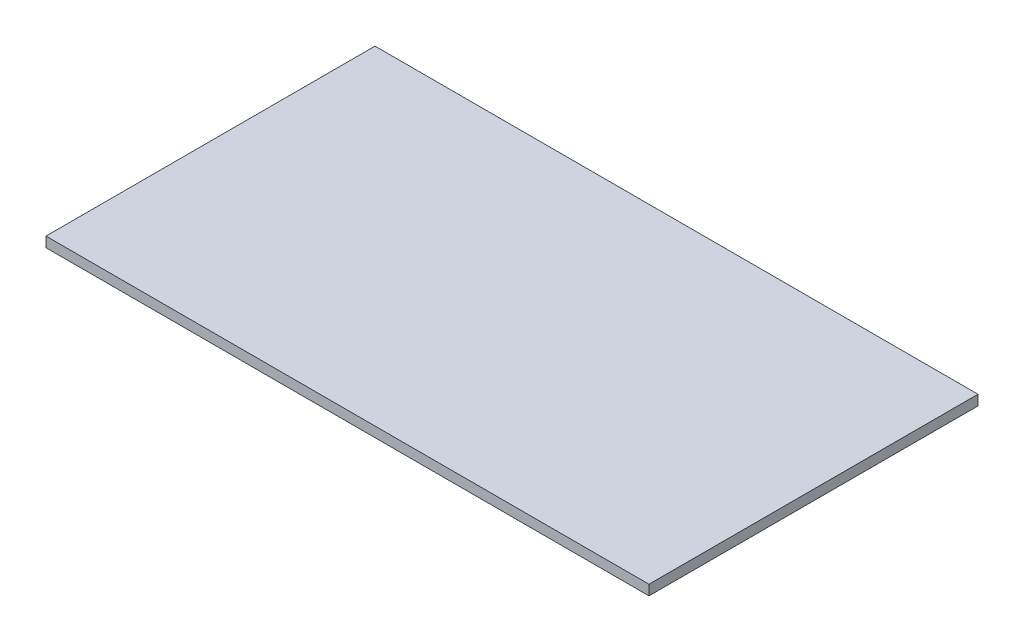
ISO-10303-21;
HEADER;
FILE_DESCRIPTION(('STEP AP214'),'2;1');
FILE_NAME('part.step','',(''),(''),'','','');
FILE_SCHEMA(('AUTOMOTIVE_DESIGN { 1 0 10303 214 1 1 1 1 }'));
ENDSEC;
DATA;
#1=APPLICATION_CONTEXT('core data for automotive mechanical design processes');
#2=APPLICATION_PROTOCOL_DEFINITION('international standard','automotive_design',2000,#1);
#3=PRODUCT_CONTEXT('',#1,'mechanical');
#4=PRODUCT('Part','Part','',(#3));
#5=PRODUCT_RELATED_PRODUCT_CATEGORY('part','',(#4));
#6=PRODUCT_DEFINITION_FORMATION('','',#4);
#7=PRODUCT_DEFINITION_CONTEXT('part definition',#1,'design');
#8=PRODUCT_DEFINITION('design','',#6,#7);
#9=PRODUCT_DEFINITION_SHAPE('','',#8);
#10=(LENGTH_UNIT() NAMED_UNIT(*) SI_UNIT(.MILLI.,.METRE.));
#11=(NAMED_UNIT(*) PLANE_ANGLE_UNIT() SI_UNIT($,.RADIAN.));
#12=(NAMED_UNIT(*) SI_UNIT($,.STERADIAN.) SOLID_ANGLE_UNIT());
#13=UNCERTAINTY_MEASURE_WITH_UNIT(LENGTH_MEASURE(1.E-05),#10,'distance_accuracy_value','');
#14=(GEOMETRIC_REPRESENTATION_CONTEXT(3) GLOBAL_UNCERTAINTY_ASSIGNED_CONTEXT((#13)) GLOBAL_UNIT_ASSIGNED_CONTEXT((#10,
#11,#12)) REPRESENTATION_CONTEXT('',''));
#15=CARTESIAN_POINT('',(0.,0.,0.));
#16=DIRECTION('',(0.,0.,1.));
#17=DIRECTION('',(1.,0.,0.));
#18=AXIS2_PLACEMENT_3D('',#15,#16,#17);
#19=CARTESIAN_POINT('',(59.6,2.,32.52));
#20=DIRECTION('',(-1.,0.,0.));
#21=DIRECTION('',(0.,0.,1.));
#22=AXIS2_PLACEMENT_3D('',#19,#20,#21);
#23=PLANE('',#22);
#24=DIRECTION('',(0.,0.,-1.));
#25=VECTOR('',#24,1.);
#26=CARTESIAN_POINT('',(59.6,0.,32.52));
#27=LINE('',#26,#25);
#28=CARTESIAN_POINT('',(59.6,0.,32.52));
#29=VERTEX_POINT('',#28);
#30=CARTESIAN_POINT('',(59.6,0.,-32.52));
#31=VERTEX_POINT('',#30);
#32=EDGE_CURVE('E98',#29,#31,#27,.T.);
#33=ORIENTED_EDGE('',*,*,#32,.T.);
#34=DIRECTION('',(0.,-1.,0.));
#35=VECTOR('',#34,1.);
#36=CARTESIAN_POINT('',(59.6,2.,-32.52));
#37=LINE('',#36,#35);
#38=CARTESIAN_POINT('',(59.6,2.,-32.52));
#39=VERTEX_POINT('',#38);
#40=EDGE_CURVE('E11',#39,#31,#37,.T.);
#41=ORIENTED_EDGE('',*,*,#40,.F.);
#42=DIRECTION('',(0.,0.,-1.));
#43=VECTOR('',#42,1.);
#44=CARTESIAN_POINT('',(59.6,2.,32.52));
#45=LINE('',#44,#43);
#46=CARTESIAN_POINT('',(59.6,2.,32.52));
#47=VERTEX_POINT('',#46);
#48=EDGE_CURVE('E86',#47,#39,#45,.T.);
#49=ORIENTED_EDGE('',*,*,#48,.F.);
#50=DIRECTION('',(0.,-1.,0.));
#51=VECTOR('',#50,1.);
#52=CARTESIAN_POINT('',(59.6,2.,32.52));
#53=LINE('',#52,#51);
#54=EDGE_CURVE('E94',#47,#29,#53,.T.);
#55=ORIENTED_EDGE('',*,*,#54,.T.);
#56=EDGE_LOOP('',(#33,#41,#49,#55));
#57=FACE_BOUND('',#56,.T.);
#58=ADVANCED_FACE('F35',(#57),#23,.F.);
#59=CARTESIAN_POINT('',(-59.6,2.,-32.52));
#60=DIRECTION('',(0.,0.,1.));
#61=DIRECTION('',(1.,0.,0.));
#62=AXIS2_PLACEMENT_3D('',#59,#60,#61);
#63=PLANE('',#62);
#64=DIRECTION('',(-1.,0.,0.));
#65=VECTOR('',#64,1.);
#66=CARTESIAN_POINT('',(-59.6,0.,-32.52));
#67=LINE('',#66,#65);
#68=CARTESIAN_POINT('',(-59.6,0.,-32.52));
#69=VERTEX_POINT('',#68);
#70=EDGE_CURVE('E90',#31,#69,#67,.T.);
#71=ORIENTED_EDGE('',*,*,#70,.T.);
#72=DIRECTION('',(0.,-1.,0.));
#73=VECTOR('',#72,1.);
#74=CARTESIAN_POINT('',(-59.6,2.,-32.52));
#75=LINE('',#74,#73);
#76=CARTESIAN_POINT('',(-59.6,2.,-32.52));
#77=VERTEX_POINT('',#76);
#78=EDGE_CURVE('E43',#77,#69,#75,.T.);
#79=ORIENTED_EDGE('',*,*,#78,.F.);
#80=DIRECTION('',(-1.,0.,0.));
#81=VECTOR('',#80,1.);
#82=CARTESIAN_POINT('',(-59.6,2.,-32.52));
#83=LINE('',#82,#81);
#84=EDGE_CURVE('E81',#39,#77,#83,.T.);
#85=ORIENTED_EDGE('',*,*,#84,.F.);
#86=ORIENTED_EDGE('',*,*,#40,.T.);
#87=EDGE_LOOP('',(#71,#79,#85,#86));
#88=FACE_BOUND('',#87,.T.);
#89=ADVANCED_FACE('F89',(#88),#63,.F.);
#90=CARTESIAN_POINT('',(-59.6,2.,32.52));
#91=DIRECTION('',(1.,0.,0.));
#92=DIRECTION('',(0.,0.,-1.));
#93=AXIS2_PLACEMENT_3D('',#90,#91,#92);
#94=PLANE('',#93);
#95=DIRECTION('',(0.,0.,1.));
#96=VECTOR('',#95,1.);
#97=CARTESIAN_POINT('',(-59.6,0.,32.52));
#98=LINE('',#97,#96);
#99=CARTESIAN_POINT('',(-59.6,0.,32.52));
#100=VERTEX_POINT('',#99);
#101=EDGE_CURVE('E68',#69,#100,#98,.T.);
#102=ORIENTED_EDGE('',*,*,#101,.T.);
#103=DIRECTION('',(0.,-1.,0.));
#104=VECTOR('',#103,1.);
#105=CARTESIAN_POINT('',(-59.6,2.,32.52));
#106=LINE('',#105,#104);
#107=CARTESIAN_POINT('',(-59.6,2.,32.52));
#108=VERTEX_POINT('',#107);
#109=EDGE_CURVE('E91',#108,#100,#106,.T.);
#110=ORIENTED_EDGE('',*,*,#109,.F.);
#111=DIRECTION('',(0.,0.,1.));
#112=VECTOR('',#111,1.);
#113=CARTESIAN_POINT('',(-59.6,2.,32.52));
#114=LINE('',#113,#112);
#115=EDGE_CURVE('E84',#77,#108,#114,.T.);
#116=ORIENTED_EDGE('',*,*,#115,.F.);
#117=ORIENTED_EDGE('',*,*,#78,.T.);
#118=EDGE_LOOP('',(#102,#110,#116,#117));
#119=FACE_BOUND('',#118,.T.);
#120=ADVANCED_FACE('F92',(#119),#94,.F.);
#121=CARTESIAN_POINT('',(-59.6,2.,32.52));
#122=DIRECTION('',(0.,0.,-1.));
#123=DIRECTION('',(-1.,0.,0.));
#124=AXIS2_PLACEMENT_3D('',#121,#122,#123);
#125=PLANE('',#124);
#126=DIRECTION('',(1.,0.,0.));
#127=VECTOR('',#126,1.);
#128=CARTESIAN_POINT('',(-59.6,0.,32.52));
#129=LINE('',#128,#127);
#130=EDGE_CURVE('E74',#100,#29,#129,.T.);
#131=ORIENTED_EDGE('',*,*,#130,.T.);
#132=ORIENTED_EDGE('',*,*,#54,.F.);
#133=DIRECTION('',(1.,0.,0.));
#134=VECTOR('',#133,1.);
#135=CARTESIAN_POINT('',(-59.6,2.,32.52));
#136=LINE('',#135,#134);
#137=EDGE_CURVE('E51',#108,#47,#136,.T.);
#138=ORIENTED_EDGE('',*,*,#137,.F.);
#139=ORIENTED_EDGE('',*,*,#109,.T.);
#140=EDGE_LOOP('',(#131,#132,#138,#139));
#141=FACE_BOUND('',#140,.T.);
#142=ADVANCED_FACE('F105',(#141),#125,.F.);
#143=CARTESIAN_POINT('',(0.,2.,0.));
#144=DIRECTION('',(0.,-1.,0.));
#145=DIRECTION('',(0.,0.,-1.));
#146=AXIS2_PLACEMENT_3D('',#143,#144,#145);
#147=PLANE('',#146);
#148=ORIENTED_EDGE('',*,*,#48,.T.);
#149=ORIENTED_EDGE('',*,*,#84,.T.);
#150=ORIENTED_EDGE('',*,*,#115,.T.);
#151=ORIENTED_EDGE('',*,*,#137,.T.);
#152=EDGE_LOOP('',(#148,#149,#150,#151));
#153=FACE_BOUND('',#152,.T.);
#154=ADVANCED_FACE('F82',(#153),#147,.F.);
#155=CARTESIAN_POINT('',(0.,0.,0.));
#156=DIRECTION('',(0.,-1.,0.));
#157=DIRECTION('',(0.,0.,-1.));
#158=AXIS2_PLACEMENT_3D('',#155,#156,#157);
#159=PLANE('',#158);
#160=ORIENTED_EDGE('',*,*,#32,.F.);
#161=ORIENTED_EDGE('',*,*,#130,.F.);
#162=ORIENTED_EDGE('',*,*,#101,.F.);
#163=ORIENTED_EDGE('',*,*,#70,.F.);
#164=EDGE_LOOP('',(#160,#161,#162,#163));
#165=FACE_BOUND('',#164,.T.);
#166=ADVANCED_FACE('F108',(#165),#159,.T.);
#167=CLOSED_SHELL('',(#58,#89,#120,#142,#154,#166));
#168=MANIFOLD_SOLID_BREP('B2',#167);
#169=ADVANCED_BREP_SHAPE_REPRESENTATION('',(#18,#168),#14);
#170=SHAPE_DEFINITION_REPRESENTATION(#9,#169);
ENDSEC;
END-ISO-10303-21;
